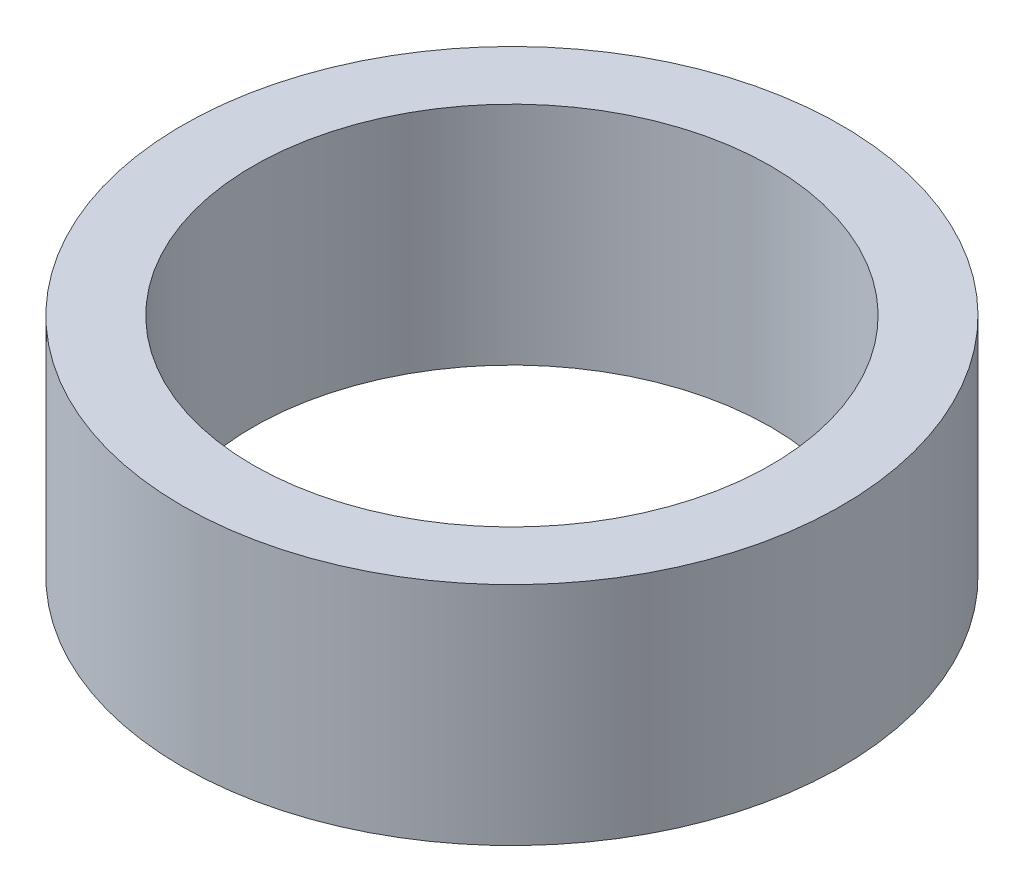
ISO-10303-21;
HEADER;
FILE_DESCRIPTION(('STEP AP214'),'2;1');
FILE_NAME('part.step','',(''),(''),'','','');
FILE_SCHEMA(('AUTOMOTIVE_DESIGN { 1 0 10303 214 1 1 1 1 }'));
ENDSEC;
DATA;
#1=APPLICATION_CONTEXT('core data for automotive mechanical design processes');
#2=APPLICATION_PROTOCOL_DEFINITION('international standard','automotive_design',2000,#1);
#3=PRODUCT_CONTEXT('',#1,'mechanical');
#4=PRODUCT('Part','Part','',(#3));
#5=PRODUCT_RELATED_PRODUCT_CATEGORY('part','',(#4));
#6=PRODUCT_DEFINITION_FORMATION('','',#4);
#7=PRODUCT_DEFINITION_CONTEXT('part definition',#1,'design');
#8=PRODUCT_DEFINITION('design','',#6,#7);
#9=PRODUCT_DEFINITION_SHAPE('','',#8);
#10=(LENGTH_UNIT() NAMED_UNIT(*) SI_UNIT(.MILLI.,.METRE.));
#11=(NAMED_UNIT(*) PLANE_ANGLE_UNIT() SI_UNIT($,.RADIAN.));
#12=(NAMED_UNIT(*) SI_UNIT($,.STERADIAN.) SOLID_ANGLE_UNIT());
#13=UNCERTAINTY_MEASURE_WITH_UNIT(LENGTH_MEASURE(1.E-05),#10,'distance_accuracy_value','');
#14=(GEOMETRIC_REPRESENTATION_CONTEXT(3) GLOBAL_UNCERTAINTY_ASSIGNED_CONTEXT((#13)) GLOBAL_UNIT_ASSIGNED_CONTEXT((#10,
#11,#12)) REPRESENTATION_CONTEXT('',''));
#15=CARTESIAN_POINT('',(0.,0.,0.));
#16=DIRECTION('',(0.,0.,1.));
#17=DIRECTION('',(1.,0.,0.));
#18=AXIS2_PLACEMENT_3D('',#15,#16,#17);
#19=CARTESIAN_POINT('',(0.,24.,0.));
#20=DIRECTION('',(0.,-1.,0.));
#21=DIRECTION('',(0.,0.,-1.));
#22=AXIS2_PLACEMENT_3D('',#19,#20,#21);
#23=CYLINDRICAL_SURFACE('',#22,35.);
#24=CARTESIAN_POINT('',(0.,24.,0.));
#25=DIRECTION('',(0.,1.,0.));
#26=DIRECTION('',(0.,0.,1.));
#27=AXIS2_PLACEMENT_3D('',#24,#25,#26);
#28=CIRCLE('',#27,35.);
#29=CARTESIAN_POINT('',(0.,24.,35.));
#30=VERTEX_POINT('',#29);
#31=EDGE_CURVE('E10',#30,#30,#28,.T.);
#32=ORIENTED_EDGE('',*,*,#31,.F.);
#33=EDGE_LOOP('',(#32));
#34=FACE_BOUND('',#33,.T.);
#35=CARTESIAN_POINT('',(0.,0.,0.));
#36=DIRECTION('',(0.,1.,0.));
#37=DIRECTION('',(0.,0.,1.));
#38=AXIS2_PLACEMENT_3D('',#35,#36,#37);
#39=CIRCLE('',#38,35.);
#40=CARTESIAN_POINT('',(0.,0.,35.));
#41=VERTEX_POINT('',#40);
#42=EDGE_CURVE('E37',#41,#41,#39,.T.);
#43=ORIENTED_EDGE('',*,*,#42,.T.);
#44=EDGE_LOOP('',(#43));
#45=FACE_BOUND('',#44,.T.);
#46=ADVANCED_FACE('F40',(#34,#45),#23,.T.);
#47=CARTESIAN_POINT('',(0.,24.,0.));
#48=DIRECTION('',(0.,1.,0.));
#49=DIRECTION('',(0.,0.,1.));
#50=AXIS2_PLACEMENT_3D('',#47,#48,#49);
#51=PLANE('',#50);
#52=CARTESIAN_POINT('',(0.,24.,0.));
#53=DIRECTION('',(0.,1.,0.));
#54=DIRECTION('',(0.,0.,1.));
#55=AXIS2_PLACEMENT_3D('',#52,#53,#54);
#56=CIRCLE('',#55,27.5);
#57=CARTESIAN_POINT('',(0.,24.,27.5));
#58=VERTEX_POINT('',#57);
#59=EDGE_CURVE('E50',#58,#58,#56,.T.);
#60=ORIENTED_EDGE('',*,*,#59,.F.);
#61=EDGE_LOOP('',(#60));
#62=FACE_BOUND('',#61,.T.);
#63=ORIENTED_EDGE('',*,*,#31,.T.);
#64=EDGE_LOOP('',(#63));
#65=FACE_BOUND('',#64,.T.);
#66=ADVANCED_FACE('F59',(#62,#65),#51,.T.);
#67=CARTESIAN_POINT('',(0.,0.,0.));
#68=DIRECTION('',(0.,1.,0.));
#69=DIRECTION('',(0.,0.,1.));
#70=AXIS2_PLACEMENT_3D('',#67,#68,#69);
#71=PLANE('',#70);
#72=CARTESIAN_POINT('',(0.,0.,0.));
#73=DIRECTION('',(0.,1.,0.));
#74=DIRECTION('',(0.,0.,1.));
#75=AXIS2_PLACEMENT_3D('',#72,#73,#74);
#76=CIRCLE('',#75,27.5);
#77=CARTESIAN_POINT('',(0.,0.,27.5));
#78=VERTEX_POINT('',#77);
#79=EDGE_CURVE('E47',#78,#78,#76,.T.);
#80=ORIENTED_EDGE('',*,*,#79,.T.);
#81=EDGE_LOOP('',(#80));
#82=FACE_BOUND('',#81,.T.);
#83=ORIENTED_EDGE('',*,*,#42,.F.);
#84=EDGE_LOOP('',(#83));
#85=FACE_BOUND('',#84,.T.);
#86=ADVANCED_FACE('F58',(#82,#85),#71,.F.);
#87=CARTESIAN_POINT('',(0.,24.,0.));
#88=DIRECTION('',(0.,-1.,0.));
#89=DIRECTION('',(0.,0.,-1.));
#90=AXIS2_PLACEMENT_3D('',#87,#88,#89);
#91=CYLINDRICAL_SURFACE('',#90,27.5);
#92=ORIENTED_EDGE('',*,*,#59,.T.);
#93=EDGE_LOOP('',(#92));
#94=FACE_BOUND('',#93,.T.);
#95=ORIENTED_EDGE('',*,*,#79,.F.);
#96=EDGE_LOOP('',(#95));
#97=FACE_BOUND('',#96,.T.);
#98=ADVANCED_FACE('F54',(#94,#97),#91,.F.);
#99=CLOSED_SHELL('',(#46,#66,#86,#98));
#100=MANIFOLD_SOLID_BREP('B2',#99);
#101=ADVANCED_BREP_SHAPE_REPRESENTATION('',(#18,#100),#14);
#102=SHAPE_DEFINITION_REPRESENTATION(#9,#101);
ENDSEC;
END-ISO-10303-21;
